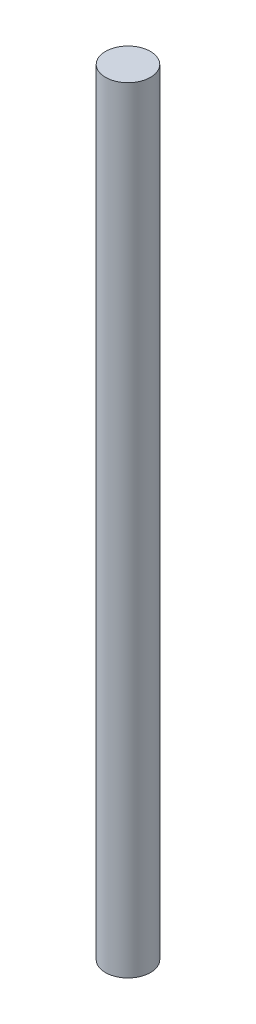
ISO-10303-21;
HEADER;
FILE_DESCRIPTION(('STEP AP214'),'2;1');
FILE_NAME('part.step','',(''),(''),'','','');
FILE_SCHEMA(('AUTOMOTIVE_DESIGN { 1 0 10303 214 1 1 1 1 }'));
ENDSEC;
DATA;
#1=APPLICATION_CONTEXT('core data for automotive mechanical design processes');
#2=APPLICATION_PROTOCOL_DEFINITION('international standard','automotive_design',2000,#1);
#3=PRODUCT_CONTEXT('',#1,'mechanical');
#4=PRODUCT('Part','Part','',(#3));
#5=PRODUCT_RELATED_PRODUCT_CATEGORY('part','',(#4));
#6=PRODUCT_DEFINITION_FORMATION('','',#4);
#7=PRODUCT_DEFINITION_CONTEXT('part definition',#1,'design');
#8=PRODUCT_DEFINITION('design','',#6,#7);
#9=PRODUCT_DEFINITION_SHAPE('','',#8);
#10=(LENGTH_UNIT() NAMED_UNIT(*) SI_UNIT(.MILLI.,.METRE.));
#11=(NAMED_UNIT(*) PLANE_ANGLE_UNIT() SI_UNIT($,.RADIAN.));
#12=(NAMED_UNIT(*) SI_UNIT($,.STERADIAN.) SOLID_ANGLE_UNIT());
#13=UNCERTAINTY_MEASURE_WITH_UNIT(LENGTH_MEASURE(1.E-05),#10,'distance_accuracy_value','');
#14=(GEOMETRIC_REPRESENTATION_CONTEXT(3) GLOBAL_UNCERTAINTY_ASSIGNED_CONTEXT((#13)) GLOBAL_UNIT_ASSIGNED_CONTEXT((#10,
#11,#12)) REPRESENTATION_CONTEXT('',''));
#15=CARTESIAN_POINT('',(0.,0.,0.));
#16=DIRECTION('',(0.,0.,1.));
#17=DIRECTION('',(1.,0.,0.));
#18=AXIS2_PLACEMENT_3D('',#15,#16,#17);
#19=CARTESIAN_POINT('',(0.,50.,0.));
#20=DIRECTION('',(0.,-1.,0.));
#21=DIRECTION('',(0.,0.,-1.));
#22=AXIS2_PLACEMENT_3D('',#19,#20,#21);
#23=CYLINDRICAL_SURFACE('',#22,1.45);
#24=CARTESIAN_POINT('',(0.,50.,0.));
#25=DIRECTION('',(0.,1.,0.));
#26=DIRECTION('',(0.,0.,1.));
#27=AXIS2_PLACEMENT_3D('',#24,#25,#26);
#28=CIRCLE('',#27,1.45);
#29=CARTESIAN_POINT('',(0.,50.,1.45));
#30=VERTEX_POINT('',#29);
#31=EDGE_CURVE('E10',#30,#30,#28,.T.);
#32=ORIENTED_EDGE('',*,*,#31,.F.);
#33=EDGE_LOOP('',(#32));
#34=FACE_BOUND('',#33,.T.);
#35=CARTESIAN_POINT('',(0.,0.,0.));
#36=DIRECTION('',(0.,1.,0.));
#37=DIRECTION('',(0.,0.,1.));
#38=AXIS2_PLACEMENT_3D('',#35,#36,#37);
#39=CIRCLE('',#38,1.45);
#40=CARTESIAN_POINT('',(0.,0.,1.45));
#41=VERTEX_POINT('',#40);
#42=EDGE_CURVE('E34',#41,#41,#39,.T.);
#43=ORIENTED_EDGE('',*,*,#42,.T.);
#44=EDGE_LOOP('',(#43));
#45=FACE_BOUND('',#44,.T.);
#46=ADVANCED_FACE('F31',(#34,#45),#23,.T.);
#47=CARTESIAN_POINT('',(0.,50.,0.));
#48=DIRECTION('',(0.,1.,0.));
#49=DIRECTION('',(0.,0.,1.));
#50=AXIS2_PLACEMENT_3D('',#47,#48,#49);
#51=PLANE('',#50);
#52=ORIENTED_EDGE('',*,*,#31,.T.);
#53=EDGE_LOOP('',(#52));
#54=FACE_BOUND('',#53,.T.);
#55=ADVANCED_FACE('F46',(#54),#51,.T.);
#56=CARTESIAN_POINT('',(0.,0.,0.));
#57=DIRECTION('',(0.,1.,0.));
#58=DIRECTION('',(0.,0.,1.));
#59=AXIS2_PLACEMENT_3D('',#56,#57,#58);
#60=PLANE('',#59);
#61=ORIENTED_EDGE('',*,*,#42,.F.);
#62=EDGE_LOOP('',(#61));
#63=FACE_BOUND('',#62,.T.);
#64=ADVANCED_FACE('F44',(#63),#60,.F.);
#65=CLOSED_SHELL('',(#46,#55,#64));
#66=MANIFOLD_SOLID_BREP('B2',#65);
#67=ADVANCED_BREP_SHAPE_REPRESENTATION('',(#18,#66),#14);
#68=SHAPE_DEFINITION_REPRESENTATION(#9,#67);
ENDSEC;
END-ISO-10303-21;
